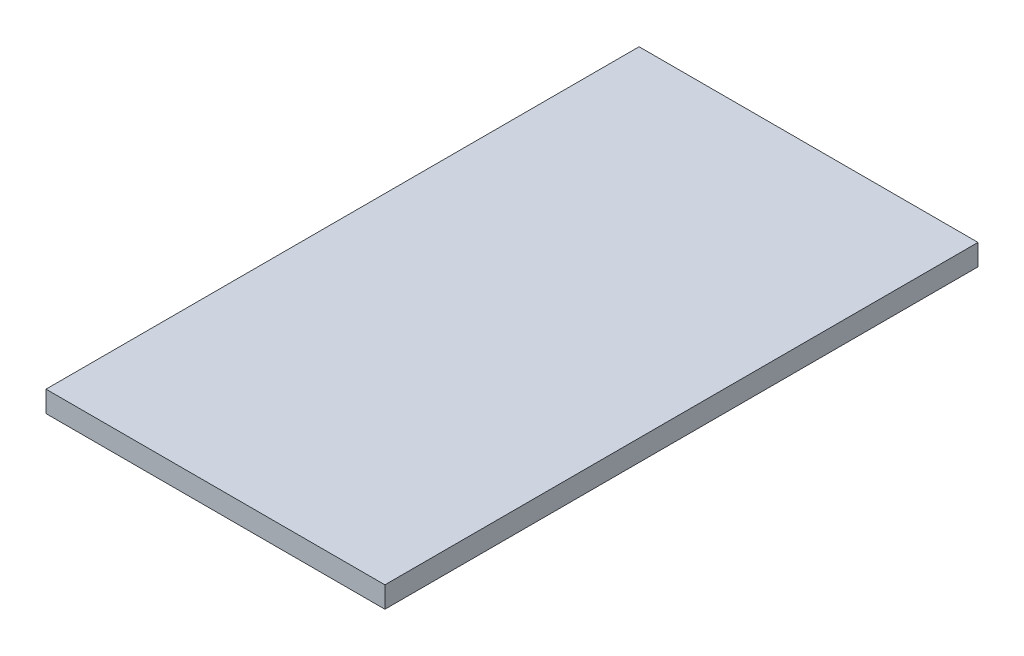
ISO-10303-21;
HEADER;
FILE_DESCRIPTION(('STEP AP214'),'2;1');
FILE_NAME('part.step','',(''),(''),'','','');
FILE_SCHEMA(('AUTOMOTIVE_DESIGN { 1 0 10303 214 1 1 1 1 }'));
ENDSEC;
DATA;
#1=APPLICATION_CONTEXT('core data for automotive mechanical design processes');
#2=APPLICATION_PROTOCOL_DEFINITION('international standard','automotive_design',2000,#1);
#3=PRODUCT_CONTEXT('',#1,'mechanical');
#4=PRODUCT('Part','Part','',(#3));
#5=PRODUCT_RELATED_PRODUCT_CATEGORY('part','',(#4));
#6=PRODUCT_DEFINITION_FORMATION('','',#4);
#7=PRODUCT_DEFINITION_CONTEXT('part definition',#1,'design');
#8=PRODUCT_DEFINITION('design','',#6,#7);
#9=PRODUCT_DEFINITION_SHAPE('','',#8);
#10=(LENGTH_UNIT() NAMED_UNIT(*) SI_UNIT(.MILLI.,.METRE.));
#11=(NAMED_UNIT(*) PLANE_ANGLE_UNIT() SI_UNIT($,.RADIAN.));
#12=(NAMED_UNIT(*) SI_UNIT($,.STERADIAN.) SOLID_ANGLE_UNIT());
#13=UNCERTAINTY_MEASURE_WITH_UNIT(LENGTH_MEASURE(1.E-05),#10,'distance_accuracy_value','');
#14=(GEOMETRIC_REPRESENTATION_CONTEXT(3) GLOBAL_UNCERTAINTY_ASSIGNED_CONTEXT((#13)) GLOBAL_UNIT_ASSIGNED_CONTEXT((#10,
#11,#12)) REPRESENTATION_CONTEXT('',''));
#15=CARTESIAN_POINT('',(0.,0.,0.));
#16=DIRECTION('',(0.,0.,1.));
#17=DIRECTION('',(1.,0.,0.));
#18=AXIS2_PLACEMENT_3D('',#15,#16,#17);
#19=CARTESIAN_POINT('',(24.,3.,-42.));
#20=DIRECTION('',(-1.,0.,0.));
#21=DIRECTION('',(0.,0.,1.));
#22=AXIS2_PLACEMENT_3D('',#19,#20,#21);
#23=PLANE('',#22);
#24=DIRECTION('',(0.,0.,-1.));
#25=VECTOR('',#24,1.);
#26=CARTESIAN_POINT('',(24.,0.,-42.));
#27=LINE('',#26,#25);
#28=CARTESIAN_POINT('',(24.,0.,42.));
#29=VERTEX_POINT('',#28);
#30=CARTESIAN_POINT('',(24.,0.,-42.));
#31=VERTEX_POINT('',#30);
#32=EDGE_CURVE('E96',#29,#31,#27,.T.);
#33=ORIENTED_EDGE('',*,*,#32,.T.);
#34=DIRECTION('',(0.,-1.,0.));
#35=VECTOR('',#34,1.);
#36=CARTESIAN_POINT('',(24.,3.,-42.));
#37=LINE('',#36,#35);
#38=CARTESIAN_POINT('',(24.,3.,-42.));
#39=VERTEX_POINT('',#38);
#40=EDGE_CURVE('E11',#39,#31,#37,.T.);
#41=ORIENTED_EDGE('',*,*,#40,.F.);
#42=DIRECTION('',(0.,0.,-1.));
#43=VECTOR('',#42,1.);
#44=CARTESIAN_POINT('',(24.,3.,-42.));
#45=LINE('',#44,#43);
#46=CARTESIAN_POINT('',(24.,3.,42.));
#47=VERTEX_POINT('',#46);
#48=EDGE_CURVE('E84',#47,#39,#45,.T.);
#49=ORIENTED_EDGE('',*,*,#48,.F.);
#50=DIRECTION('',(0.,-1.,0.));
#51=VECTOR('',#50,1.);
#52=CARTESIAN_POINT('',(24.,3.,42.));
#53=LINE('',#52,#51);
#54=EDGE_CURVE('E92',#47,#29,#53,.T.);
#55=ORIENTED_EDGE('',*,*,#54,.T.);
#56=EDGE_LOOP('',(#33,#41,#49,#55));
#57=FACE_BOUND('',#56,.T.);
#58=ADVANCED_FACE('F33',(#57),#23,.F.);
#59=CARTESIAN_POINT('',(-24.,3.,-42.));
#60=DIRECTION('',(0.,0.,1.));
#61=DIRECTION('',(1.,0.,0.));
#62=AXIS2_PLACEMENT_3D('',#59,#60,#61);
#63=PLANE('',#62);
#64=DIRECTION('',(-1.,0.,0.));
#65=VECTOR('',#64,1.);
#66=CARTESIAN_POINT('',(-24.,0.,-42.));
#67=LINE('',#66,#65);
#68=CARTESIAN_POINT('',(-24.,0.,-42.));
#69=VERTEX_POINT('',#68);
#70=EDGE_CURVE('E88',#31,#69,#67,.T.);
#71=ORIENTED_EDGE('',*,*,#70,.T.);
#72=DIRECTION('',(0.,-1.,0.));
#73=VECTOR('',#72,1.);
#74=CARTESIAN_POINT('',(-24.,3.,-42.));
#75=LINE('',#74,#73);
#76=CARTESIAN_POINT('',(-24.,3.,-42.));
#77=VERTEX_POINT('',#76);
#78=EDGE_CURVE('E41',#77,#69,#75,.T.);
#79=ORIENTED_EDGE('',*,*,#78,.F.);
#80=DIRECTION('',(-1.,0.,0.));
#81=VECTOR('',#80,1.);
#82=CARTESIAN_POINT('',(-24.,3.,-42.));
#83=LINE('',#82,#81);
#84=EDGE_CURVE('E79',#39,#77,#83,.T.);
#85=ORIENTED_EDGE('',*,*,#84,.F.);
#86=ORIENTED_EDGE('',*,*,#40,.T.);
#87=EDGE_LOOP('',(#71,#79,#85,#86));
#88=FACE_BOUND('',#87,.T.);
#89=ADVANCED_FACE('F87',(#88),#63,.F.);
#90=CARTESIAN_POINT('',(-24.,3.,-42.));
#91=DIRECTION('',(1.,0.,0.));
#92=DIRECTION('',(0.,0.,-1.));
#93=AXIS2_PLACEMENT_3D('',#90,#91,#92);
#94=PLANE('',#93);
#95=DIRECTION('',(0.,0.,1.));
#96=VECTOR('',#95,1.);
#97=CARTESIAN_POINT('',(-24.,0.,-42.));
#98=LINE('',#97,#96);
#99=CARTESIAN_POINT('',(-24.,0.,42.));
#100=VERTEX_POINT('',#99);
#101=EDGE_CURVE('E66',#69,#100,#98,.T.);
#102=ORIENTED_EDGE('',*,*,#101,.T.);
#103=DIRECTION('',(0.,-1.,0.));
#104=VECTOR('',#103,1.);
#105=CARTESIAN_POINT('',(-24.,3.,42.));
#106=LINE('',#105,#104);
#107=CARTESIAN_POINT('',(-24.,3.,42.));
#108=VERTEX_POINT('',#107);
#109=EDGE_CURVE('E89',#108,#100,#106,.T.);
#110=ORIENTED_EDGE('',*,*,#109,.F.);
#111=DIRECTION('',(0.,0.,1.));
#112=VECTOR('',#111,1.);
#113=CARTESIAN_POINT('',(-24.,3.,-42.));
#114=LINE('',#113,#112);
#115=EDGE_CURVE('E82',#77,#108,#114,.T.);
#116=ORIENTED_EDGE('',*,*,#115,.F.);
#117=ORIENTED_EDGE('',*,*,#78,.T.);
#118=EDGE_LOOP('',(#102,#110,#116,#117));
#119=FACE_BOUND('',#118,.T.);
#120=ADVANCED_FACE('F90',(#119),#94,.F.);
#121=CARTESIAN_POINT('',(-24.,3.,42.));
#122=DIRECTION('',(0.,0.,-1.));
#123=DIRECTION('',(-1.,0.,0.));
#124=AXIS2_PLACEMENT_3D('',#121,#122,#123);
#125=PLANE('',#124);
#126=DIRECTION('',(1.,0.,0.));
#127=VECTOR('',#126,1.);
#128=CARTESIAN_POINT('',(-24.,0.,42.));
#129=LINE('',#128,#127);
#130=EDGE_CURVE('E72',#100,#29,#129,.T.);
#131=ORIENTED_EDGE('',*,*,#130,.T.);
#132=ORIENTED_EDGE('',*,*,#54,.F.);
#133=DIRECTION('',(1.,0.,0.));
#134=VECTOR('',#133,1.);
#135=CARTESIAN_POINT('',(-24.,3.,42.));
#136=LINE('',#135,#134);
#137=EDGE_CURVE('E49',#108,#47,#136,.T.);
#138=ORIENTED_EDGE('',*,*,#137,.F.);
#139=ORIENTED_EDGE('',*,*,#109,.T.);
#140=EDGE_LOOP('',(#131,#132,#138,#139));
#141=FACE_BOUND('',#140,.T.);
#142=ADVANCED_FACE('F103',(#141),#125,.F.);
#143=CARTESIAN_POINT('',(0.,3.,0.));
#144=DIRECTION('',(0.,1.,0.));
#145=DIRECTION('',(0.,0.,1.));
#146=AXIS2_PLACEMENT_3D('',#143,#144,#145);
#147=PLANE('',#146);
#148=ORIENTED_EDGE('',*,*,#48,.T.);
#149=ORIENTED_EDGE('',*,*,#84,.T.);
#150=ORIENTED_EDGE('',*,*,#115,.T.);
#151=ORIENTED_EDGE('',*,*,#137,.T.);
#152=EDGE_LOOP('',(#148,#149,#150,#151));
#153=FACE_BOUND('',#152,.T.);
#154=ADVANCED_FACE('F80',(#153),#147,.T.);
#155=CARTESIAN_POINT('',(0.,0.,0.));
#156=DIRECTION('',(0.,1.,0.));
#157=DIRECTION('',(0.,0.,1.));
#158=AXIS2_PLACEMENT_3D('',#155,#156,#157);
#159=PLANE('',#158);
#160=ORIENTED_EDGE('',*,*,#32,.F.);
#161=ORIENTED_EDGE('',*,*,#130,.F.);
#162=ORIENTED_EDGE('',*,*,#101,.F.);
#163=ORIENTED_EDGE('',*,*,#70,.F.);
#164=EDGE_LOOP('',(#160,#161,#162,#163));
#165=FACE_BOUND('',#164,.T.);
#166=ADVANCED_FACE('F106',(#165),#159,.F.);
#167=CLOSED_SHELL('',(#58,#89,#120,#142,#154,#166));
#168=MANIFOLD_SOLID_BREP('B2',#167);
#169=ADVANCED_BREP_SHAPE_REPRESENTATION('',(#18,#168),#14);
#170=SHAPE_DEFINITION_REPRESENTATION(#9,#169);
ENDSEC;
END-ISO-10303-21;
